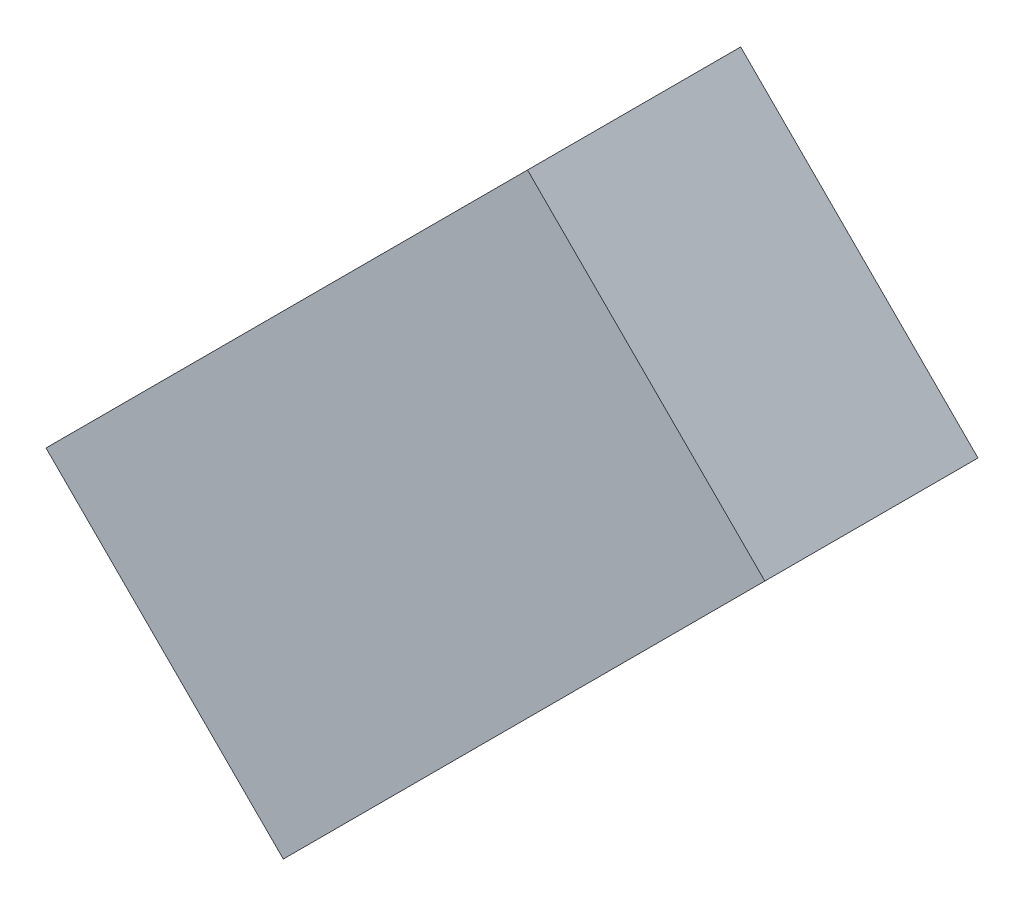
ISO-10303-21;
HEADER;
FILE_DESCRIPTION(('STEP AP214'),'2;1');
FILE_NAME('part.step','',(''),(''),'','','');
FILE_SCHEMA(('AUTOMOTIVE_DESIGN { 1 0 10303 214 1 1 1 1 }'));
ENDSEC;
DATA;
#1=APPLICATION_CONTEXT('core data for automotive mechanical design processes');
#2=APPLICATION_PROTOCOL_DEFINITION('international standard','automotive_design',2000,#1);
#3=PRODUCT_CONTEXT('',#1,'mechanical');
#4=PRODUCT('Part','Part','',(#3));
#5=PRODUCT_RELATED_PRODUCT_CATEGORY('part','',(#4));
#6=PRODUCT_DEFINITION_FORMATION('','',#4);
#7=PRODUCT_DEFINITION_CONTEXT('part definition',#1,'design');
#8=PRODUCT_DEFINITION('design','',#6,#7);
#9=PRODUCT_DEFINITION_SHAPE('','',#8);
#10=(LENGTH_UNIT() NAMED_UNIT(*) SI_UNIT(.MILLI.,.METRE.));
#11=(NAMED_UNIT(*) PLANE_ANGLE_UNIT() SI_UNIT($,.RADIAN.));
#12=(NAMED_UNIT(*) SI_UNIT($,.STERADIAN.) SOLID_ANGLE_UNIT());
#13=UNCERTAINTY_MEASURE_WITH_UNIT(LENGTH_MEASURE(1.E-05),#10,'distance_accuracy_value','');
#14=(GEOMETRIC_REPRESENTATION_CONTEXT(3) GLOBAL_UNCERTAINTY_ASSIGNED_CONTEXT((#13)) GLOBAL_UNIT_ASSIGNED_CONTEXT((#10,
#11,#12)) REPRESENTATION_CONTEXT('',''));
#15=CARTESIAN_POINT('',(0.,0.,0.));
#16=DIRECTION('',(0.,0.,1.));
#17=DIRECTION('',(1.,0.,0.));
#18=AXIS2_PLACEMENT_3D('',#15,#16,#17);
#19=CARTESIAN_POINT('',(19.1595886494445,-17.1102442985122,1.12000000000003));
#20=DIRECTION('',(0.,0.,-1.));
#21=DIRECTION('',(-1.,0.,0.));
#22=AXIS2_PLACEMENT_3D('',#19,#20,#21);
#23=PLANE('',#22);
#24=DIRECTION('',(-0.707106781186748,-0.707106781186347,0.));
#25=VECTOR('',#24,1.);
#26=CARTESIAN_POINT('',(-6.17319658950799,8.22254094045463,1.12000000000002));
#27=LINE('',#26,#25);
#28=CARTESIAN_POINT('',(-11.4347370216018,2.96100050836378,1.12000000000002));
#29=VERTEX_POINT('',#28);
#30=CARTESIAN_POINT('',(-9.17581999941378,5.21991753055054,1.12000000000002));
#31=VERTEX_POINT('',#30);
#32=EDGE_CURVE('E79',#29,#31,#27,.F.);
#33=ORIENTED_EDGE('',*,*,#32,.F.);
#34=DIRECTION('',(-0.707106781186348,0.707106781186747,0.));
#35=VECTOR('',#34,1.);
#36=CARTESIAN_POINT('',(13.8980482173507,-22.371784730603,1.12000000000002));
#37=LINE('',#36,#35);
#38=CARTESIAN_POINT('',(-10.3213140148906,1.84757750165192,1.12000000000002));
#39=VERTEX_POINT('',#38);
#40=EDGE_CURVE('E61',#29,#39,#37,.F.);
#41=ORIENTED_EDGE('',*,*,#40,.T.);
#42=DIRECTION('',(0.707106781186748,0.707106781186347,0.));
#43=VECTOR('',#42,1.);
#44=CARTESIAN_POINT('',(-5.05977358279676,7.10911793374277,1.12000000000002));
#45=LINE('',#44,#43);
#46=CARTESIAN_POINT('',(-8.06239699270255,4.10649452383868,1.12000000000002));
#47=VERTEX_POINT('',#46);
#48=EDGE_CURVE('E56',#47,#39,#45,.F.);
#49=ORIENTED_EDGE('',*,*,#48,.F.);
#50=DIRECTION('',(-0.707106781186348,0.707106781186747,0.));
#51=VECTOR('',#50,1.);
#52=CARTESIAN_POINT('',(16.1569652395387,-20.1128677084162,1.12000000000002));
#53=LINE('',#52,#51);
#54=EDGE_CURVE('E20',#31,#47,#53,.F.);
#55=ORIENTED_EDGE('',*,*,#54,.F.);
#56=EDGE_LOOP('',(#33,#41,#49,#55));
#57=FACE_BOUND('',#56,.T.);
#58=ADVANCED_FACE('F17',(#57),#23,.F.);
#59=CARTESIAN_POINT('',(16.1569652395387,-20.1128677084162,0.120000000000025));
#60=DIRECTION('',(0.707106781186747,0.707106781186348,0.));
#61=DIRECTION('',(-0.707106781186348,0.707106781186747,0.));
#62=AXIS2_PLACEMENT_3D('',#59,#60,#61);
#63=PLANE('',#62);
#64=DIRECTION('',(0.707106781186346,-0.707106781186749,0.));
#65=VECTOR('',#64,1.);
#66=CARTESIAN_POINT('',(-9.17581999941379,5.21991753055053,0.120000000000017));
#67=LINE('',#66,#65);
#68=CARTESIAN_POINT('',(-9.17581999941378,5.21991753055054,0.120000000000017));
#69=VERTEX_POINT('',#68);
#70=CARTESIAN_POINT('',(-8.06239699270255,4.10649452383868,0.120000000000017));
#71=VERTEX_POINT('',#70);
#72=EDGE_CURVE('E83',#69,#71,#67,.T.);
#73=ORIENTED_EDGE('',*,*,#72,.F.);
#74=DIRECTION('',(0.,0.,1.));
#75=VECTOR('',#74,1.);
#76=CARTESIAN_POINT('',(-9.17581999941379,5.21991753055053,0.120000000000018));
#77=LINE('',#76,#75);
#78=EDGE_CURVE('E68',#31,#69,#77,.F.);
#79=ORIENTED_EDGE('',*,*,#78,.F.);
#80=ORIENTED_EDGE('',*,*,#54,.T.);
#81=DIRECTION('',(0.,0.,1.));
#82=VECTOR('',#81,1.);
#83=CARTESIAN_POINT('',(-8.06239699270256,4.10649452383867,0.120000000000019));
#84=LINE('',#83,#82);
#85=EDGE_CURVE('E63',#71,#47,#84,.T.);
#86=ORIENTED_EDGE('',*,*,#85,.F.);
#87=EDGE_LOOP('',(#73,#79,#80,#86));
#88=FACE_BOUND('',#87,.T.);
#89=ADVANCED_FACE('F65',(#88),#63,.T.);
#90=CARTESIAN_POINT('',(-5.05977358279676,7.10911793374277,0.120000000000019));
#91=DIRECTION('',(0.707106781186347,-0.707106781186748,0.));
#92=DIRECTION('',(0.707106781186748,0.707106781186347,0.));
#93=AXIS2_PLACEMENT_3D('',#90,#91,#92);
#94=PLANE('',#93);
#95=DIRECTION('',(-0.707106781186748,-0.707106781186347,0.));
#96=VECTOR('',#95,1.);
#97=CARTESIAN_POINT('',(-8.06239699270256,4.10649452383867,0.120000000000017));
#98=LINE('',#97,#96);
#99=CARTESIAN_POINT('',(-10.3213140148906,1.84757750165192,0.120000000000015));
#100=VERTEX_POINT('',#99);
#101=EDGE_CURVE('E72',#71,#100,#98,.T.);
#102=ORIENTED_EDGE('',*,*,#101,.F.);
#103=ORIENTED_EDGE('',*,*,#85,.T.);
#104=ORIENTED_EDGE('',*,*,#48,.T.);
#105=DIRECTION('',(0.,0.,1.));
#106=VECTOR('',#105,1.);
#107=CARTESIAN_POINT('',(-10.3213140148906,1.84757750165194,0.120000000000023));
#108=LINE('',#107,#106);
#109=EDGE_CURVE('E74',#39,#100,#108,.F.);
#110=ORIENTED_EDGE('',*,*,#109,.T.);
#111=EDGE_LOOP('',(#102,#103,#104,#110));
#112=FACE_BOUND('',#111,.T.);
#113=ADVANCED_FACE('F70',(#112),#94,.T.);
#114=CARTESIAN_POINT('',(13.8980482173507,-22.371784730603,0.120000000000023));
#115=DIRECTION('',(0.707106781186747,0.707106781186348,0.));
#116=DIRECTION('',(-0.707106781186348,0.707106781186747,0.));
#117=AXIS2_PLACEMENT_3D('',#114,#115,#116);
#118=PLANE('',#117);
#119=DIRECTION('',(0.,0.,1.));
#120=VECTOR('',#119,1.);
#121=CARTESIAN_POINT('',(-11.4347370216018,2.96100050836379,0.120000000000018));
#122=LINE('',#121,#120);
#123=CARTESIAN_POINT('',(-11.4347370216018,2.96100050836378,0.120000000000015));
#124=VERTEX_POINT('',#123);
#125=EDGE_CURVE('E35',#124,#29,#122,.T.);
#126=ORIENTED_EDGE('',*,*,#125,.F.);
#127=DIRECTION('',(-0.707106781186338,0.707106781186757,0.));
#128=VECTOR('',#127,1.);
#129=CARTESIAN_POINT('',(-10.3213140148906,1.84757750165191,0.120000000000016));
#130=LINE('',#129,#128);
#131=EDGE_CURVE('E26',#100,#124,#130,.T.);
#132=ORIENTED_EDGE('',*,*,#131,.F.);
#133=ORIENTED_EDGE('',*,*,#109,.F.);
#134=ORIENTED_EDGE('',*,*,#40,.F.);
#135=EDGE_LOOP('',(#126,#132,#133,#134));
#136=FACE_BOUND('',#135,.T.);
#137=ADVANCED_FACE('F89',(#136),#118,.F.);
#138=CARTESIAN_POINT('',(-6.17319658950799,8.22254094045463,0.120000000000018));
#139=DIRECTION('',(-0.707106781186347,0.707106781186748,0.));
#140=DIRECTION('',(-0.707106781186748,-0.707106781186347,0.));
#141=AXIS2_PLACEMENT_3D('',#138,#139,#140);
#142=PLANE('',#141);
#143=DIRECTION('',(0.707106781186743,0.707106781186352,0.));
#144=VECTOR('',#143,1.);
#145=CARTESIAN_POINT('',(-11.4347370216018,2.96100050836377,0.120000000000016));
#146=LINE('',#145,#144);
#147=EDGE_CURVE('E11',#124,#69,#146,.T.);
#148=ORIENTED_EDGE('',*,*,#147,.F.);
#149=ORIENTED_EDGE('',*,*,#125,.T.);
#150=ORIENTED_EDGE('',*,*,#32,.T.);
#151=ORIENTED_EDGE('',*,*,#78,.T.);
#152=EDGE_LOOP('',(#148,#149,#150,#151));
#153=FACE_BOUND('',#152,.T.);
#154=ADVANCED_FACE('F91',(#153),#142,.T.);
#155=CARTESIAN_POINT('',(19.1595886494445,-17.1102442985122,0.120000000000027));
#156=DIRECTION('',(0.,0.,-1.));
#157=DIRECTION('',(-1.,0.,0.));
#158=AXIS2_PLACEMENT_3D('',#155,#156,#157);
#159=PLANE('',#158);
#160=ORIENTED_EDGE('',*,*,#131,.T.);
#161=ORIENTED_EDGE('',*,*,#147,.T.);
#162=ORIENTED_EDGE('',*,*,#72,.T.);
#163=ORIENTED_EDGE('',*,*,#101,.T.);
#164=EDGE_LOOP('',(#160,#161,#162,#163));
#165=FACE_BOUND('',#164,.T.);
#166=ADVANCED_FACE('F88',(#165),#159,.T.);
#167=CLOSED_SHELL('',(#58,#89,#113,#137,#154,#166));
#168=MANIFOLD_SOLID_BREP('B1',#167);
#169=ADVANCED_BREP_SHAPE_REPRESENTATION('',(#18,#168),#14);
#170=SHAPE_DEFINITION_REPRESENTATION(#9,#169);
ENDSEC;
END-ISO-10303-21;
